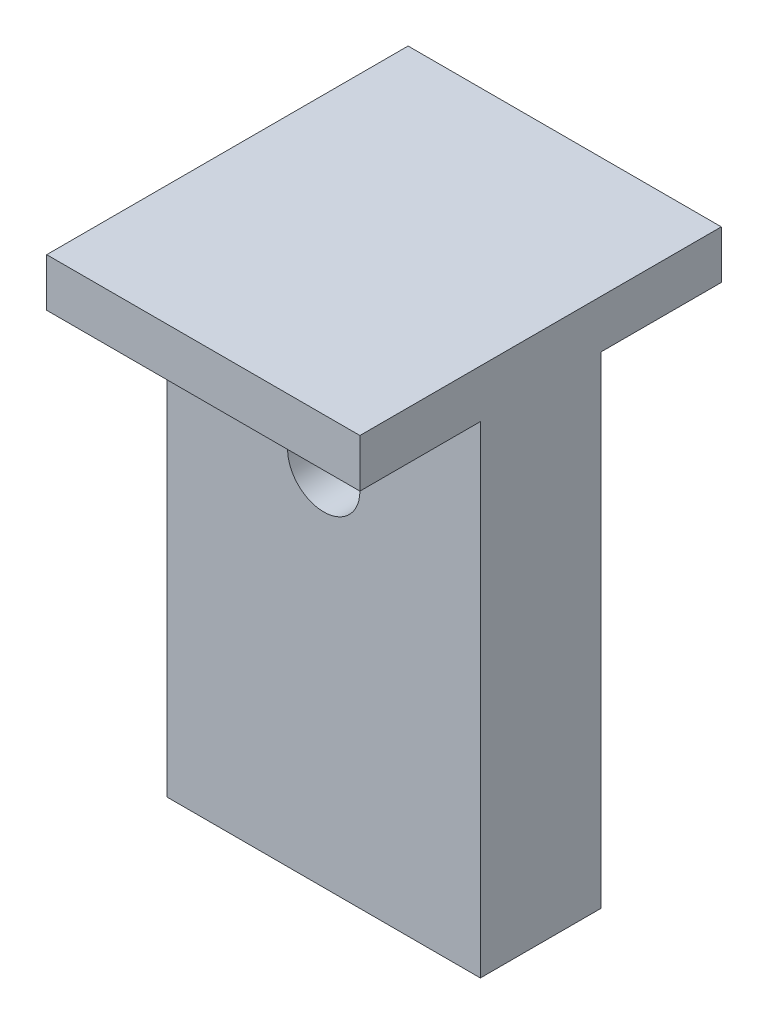
ISO-10303-21;
HEADER;
FILE_DESCRIPTION(('STEP AP214'),'2;1');
FILE_NAME('part.step','',(''),(''),'','','');
FILE_SCHEMA(('AUTOMOTIVE_DESIGN { 1 0 10303 214 1 1 1 1 }'));
ENDSEC;
DATA;
#1=APPLICATION_CONTEXT('core data for automotive mechanical design processes');
#2=APPLICATION_PROTOCOL_DEFINITION('international standard','automotive_design',2000,#1);
#3=PRODUCT_CONTEXT('',#1,'mechanical');
#4=PRODUCT('Part','Part','',(#3));
#5=PRODUCT_RELATED_PRODUCT_CATEGORY('part','',(#4));
#6=PRODUCT_DEFINITION_FORMATION('','',#4);
#7=PRODUCT_DEFINITION_CONTEXT('part definition',#1,'design');
#8=PRODUCT_DEFINITION('design','',#6,#7);
#9=PRODUCT_DEFINITION_SHAPE('','',#8);
#10=(LENGTH_UNIT() NAMED_UNIT(*) SI_UNIT(.MILLI.,.METRE.));
#11=(NAMED_UNIT(*) PLANE_ANGLE_UNIT() SI_UNIT($,.RADIAN.));
#12=(NAMED_UNIT(*) SI_UNIT($,.STERADIAN.) SOLID_ANGLE_UNIT());
#13=UNCERTAINTY_MEASURE_WITH_UNIT(LENGTH_MEASURE(1.E-05),#10,'distance_accuracy_value','');
#14=(GEOMETRIC_REPRESENTATION_CONTEXT(3) GLOBAL_UNCERTAINTY_ASSIGNED_CONTEXT((#13)) GLOBAL_UNIT_ASSIGNED_CONTEXT((#10,
#11,#12)) REPRESENTATION_CONTEXT('',''));
#15=CARTESIAN_POINT('',(0.,0.,0.));
#16=DIRECTION('',(0.,0.,1.));
#17=DIRECTION('',(1.,0.,0.));
#18=AXIS2_PLACEMENT_3D('',#15,#16,#17);
#19=CARTESIAN_POINT('',(6.5,20.,-2.5));
#20=DIRECTION('',(-1.,0.,0.));
#21=DIRECTION('',(0.,0.,1.));
#22=AXIS2_PLACEMENT_3D('',#19,#20,#21);
#23=PLANE('',#22);
#24=DIRECTION('',(0.,0.,-1.));
#25=VECTOR('',#24,1.);
#26=CARTESIAN_POINT('',(6.5,0.,-2.5));
#27=LINE('',#26,#25);
#28=CARTESIAN_POINT('',(6.5,0.,2.5));
#29=VERTEX_POINT('',#28);
#30=CARTESIAN_POINT('',(6.5,0.,-2.5));
#31=VERTEX_POINT('',#30);
#32=EDGE_CURVE('E186',#29,#31,#27,.T.);
#33=ORIENTED_EDGE('',*,*,#32,.T.);
#34=DIRECTION('',(0.,-1.,0.));
#35=VECTOR('',#34,1.);
#36=CARTESIAN_POINT('',(6.5,20.,-2.5));
#37=LINE('',#36,#35);
#38=CARTESIAN_POINT('',(6.5,20.,-2.5));
#39=VERTEX_POINT('',#38);
#40=EDGE_CURVE('E11',#39,#31,#37,.T.);
#41=ORIENTED_EDGE('',*,*,#40,.F.);
#42=DIRECTION('',(0.,0.,-1.));
#43=VECTOR('',#42,1.);
#44=CARTESIAN_POINT('',(6.5,20.,-7.5));
#45=LINE('',#44,#43);
#46=CARTESIAN_POINT('',(6.5,20.,-7.5));
#47=VERTEX_POINT('',#46);
#48=EDGE_CURVE('E231',#39,#47,#45,.T.);
#49=ORIENTED_EDGE('',*,*,#48,.T.);
#50=DIRECTION('',(0.,-1.,0.));
#51=VECTOR('',#50,1.);
#52=CARTESIAN_POINT('',(6.5,22.,-7.5));
#53=LINE('',#52,#51);
#54=CARTESIAN_POINT('',(6.5,22.,-7.5));
#55=VERTEX_POINT('',#54);
#56=EDGE_CURVE('E155',#55,#47,#53,.T.);
#57=ORIENTED_EDGE('',*,*,#56,.F.);
#58=DIRECTION('',(0.,0.,-1.));
#59=VECTOR('',#58,1.);
#60=CARTESIAN_POINT('',(6.5,22.,-7.5));
#61=LINE('',#60,#59);
#62=CARTESIAN_POINT('',(6.5,22.,7.5));
#63=VERTEX_POINT('',#62);
#64=EDGE_CURVE('E131',#63,#55,#61,.T.);
#65=ORIENTED_EDGE('',*,*,#64,.F.);
#66=DIRECTION('',(0.,-1.,0.));
#67=VECTOR('',#66,1.);
#68=CARTESIAN_POINT('',(6.5,22.,7.5));
#69=LINE('',#68,#67);
#70=CARTESIAN_POINT('',(6.5,20.,7.5));
#71=VERTEX_POINT('',#70);
#72=EDGE_CURVE('E127',#63,#71,#69,.T.);
#73=ORIENTED_EDGE('',*,*,#72,.T.);
#74=CARTESIAN_POINT('',(6.5,20.,2.5));
#75=VERTEX_POINT('',#74);
#76=EDGE_CURVE('E218',#71,#75,#45,.T.);
#77=ORIENTED_EDGE('',*,*,#76,.T.);
#78=DIRECTION('',(0.,-1.,0.));
#79=VECTOR('',#78,1.);
#80=CARTESIAN_POINT('',(6.5,20.,2.5));
#81=LINE('',#80,#79);
#82=EDGE_CURVE('E193',#75,#29,#81,.T.);
#83=ORIENTED_EDGE('',*,*,#82,.T.);
#84=EDGE_LOOP('',(#33,#41,#49,#57,#65,#73,#77,#83));
#85=FACE_BOUND('',#84,.T.);
#86=ADVANCED_FACE('F40',(#85),#23,.F.);
#87=CARTESIAN_POINT('',(-6.5,20.,-2.5));
#88=DIRECTION('',(0.,0.,1.));
#89=DIRECTION('',(1.,0.,0.));
#90=AXIS2_PLACEMENT_3D('',#87,#88,#89);
#91=PLANE('',#90);
#92=CARTESIAN_POINT('',(0.,15.,-2.5));
#93=DIRECTION('',(0.,0.,1.));
#94=DIRECTION('',(1.,0.,0.));
#95=AXIS2_PLACEMENT_3D('',#92,#93,#94);
#96=CIRCLE('',#95,1.5);
#97=CARTESIAN_POINT('',(1.5,15.,-2.5));
#98=VERTEX_POINT('',#97);
#99=EDGE_CURVE('E153',#98,#98,#96,.T.);
#100=ORIENTED_EDGE('',*,*,#99,.T.);
#101=EDGE_LOOP('',(#100));
#102=FACE_BOUND('',#101,.T.);
#103=DIRECTION('',(-1.,0.,0.));
#104=VECTOR('',#103,1.);
#105=CARTESIAN_POINT('',(-6.5,0.,-2.5));
#106=LINE('',#105,#104);
#107=CARTESIAN_POINT('',(-6.5,0.,-2.5));
#108=VERTEX_POINT('',#107);
#109=EDGE_CURVE('E197',#31,#108,#106,.T.);
#110=ORIENTED_EDGE('',*,*,#109,.T.);
#111=DIRECTION('',(0.,-1.,0.));
#112=VECTOR('',#111,1.);
#113=CARTESIAN_POINT('',(-6.5,20.,-2.5));
#114=LINE('',#113,#112);
#115=CARTESIAN_POINT('',(-6.5,20.,-2.5));
#116=VERTEX_POINT('',#115);
#117=EDGE_CURVE('E49',#116,#108,#114,.T.);
#118=ORIENTED_EDGE('',*,*,#117,.F.);
#119=DIRECTION('',(-1.,0.,0.));
#120=VECTOR('',#119,1.);
#121=CARTESIAN_POINT('',(-6.5,20.,-2.5));
#122=LINE('',#121,#120);
#123=EDGE_CURVE('E83',#39,#116,#122,.T.);
#124=ORIENTED_EDGE('',*,*,#123,.F.);
#125=ORIENTED_EDGE('',*,*,#40,.T.);
#126=EDGE_LOOP('',(#110,#118,#124,#125));
#127=FACE_BOUND('',#126,.T.);
#128=ADVANCED_FACE('F265',(#102,#127),#91,.F.);
#129=CARTESIAN_POINT('',(-6.5,20.,-2.5));
#130=DIRECTION('',(1.,0.,0.));
#131=DIRECTION('',(0.,0.,-1.));
#132=AXIS2_PLACEMENT_3D('',#129,#130,#131);
#133=PLANE('',#132);
#134=DIRECTION('',(0.,0.,1.));
#135=VECTOR('',#134,1.);
#136=CARTESIAN_POINT('',(-6.5,0.,-2.5));
#137=LINE('',#136,#135);
#138=CARTESIAN_POINT('',(-6.5,0.,2.5));
#139=VERTEX_POINT('',#138);
#140=EDGE_CURVE('E73',#108,#139,#137,.T.);
#141=ORIENTED_EDGE('',*,*,#140,.T.);
#142=DIRECTION('',(0.,-1.,0.));
#143=VECTOR('',#142,1.);
#144=CARTESIAN_POINT('',(-6.5,20.,2.5));
#145=LINE('',#144,#143);
#146=CARTESIAN_POINT('',(-6.5,20.,2.5));
#147=VERTEX_POINT('',#146);
#148=EDGE_CURVE('E57',#147,#139,#145,.T.);
#149=ORIENTED_EDGE('',*,*,#148,.F.);
#150=DIRECTION('',(0.,0.,1.));
#151=VECTOR('',#150,1.);
#152=CARTESIAN_POINT('',(-6.5,20.,-7.5));
#153=LINE('',#152,#151);
#154=CARTESIAN_POINT('',(-6.5,20.,7.5));
#155=VERTEX_POINT('',#154);
#156=EDGE_CURVE('E145',#147,#155,#153,.T.);
#157=ORIENTED_EDGE('',*,*,#156,.T.);
#158=DIRECTION('',(0.,-1.,0.));
#159=VECTOR('',#158,1.);
#160=CARTESIAN_POINT('',(-6.5,22.,7.5));
#161=LINE('',#160,#159);
#162=CARTESIAN_POINT('',(-6.5,22.,7.5));
#163=VERTEX_POINT('',#162);
#164=EDGE_CURVE('E125',#163,#155,#161,.T.);
#165=ORIENTED_EDGE('',*,*,#164,.F.);
#166=DIRECTION('',(0.,0.,1.));
#167=VECTOR('',#166,1.);
#168=CARTESIAN_POINT('',(-6.5,22.,-7.5));
#169=LINE('',#168,#167);
#170=CARTESIAN_POINT('',(-6.5,22.,-7.5));
#171=VERTEX_POINT('',#170);
#172=EDGE_CURVE('E132',#171,#163,#169,.T.);
#173=ORIENTED_EDGE('',*,*,#172,.F.);
#174=DIRECTION('',(0.,-1.,0.));
#175=VECTOR('',#174,1.);
#176=CARTESIAN_POINT('',(-6.5,22.,-7.5));
#177=LINE('',#176,#175);
#178=CARTESIAN_POINT('',(-6.5,20.,-7.5));
#179=VERTEX_POINT('',#178);
#180=EDGE_CURVE('E236',#171,#179,#177,.T.);
#181=ORIENTED_EDGE('',*,*,#180,.T.);
#182=EDGE_CURVE('E210',#179,#116,#153,.T.);
#183=ORIENTED_EDGE('',*,*,#182,.T.);
#184=ORIENTED_EDGE('',*,*,#117,.T.);
#185=EDGE_LOOP('',(#141,#149,#157,#165,#173,#181,#183,#184));
#186=FACE_BOUND('',#185,.T.);
#187=ADVANCED_FACE('F143',(#186),#133,.F.);
#188=CARTESIAN_POINT('',(-6.5,20.,2.5));
#189=DIRECTION('',(0.,0.,-1.));
#190=DIRECTION('',(-1.,0.,0.));
#191=AXIS2_PLACEMENT_3D('',#188,#189,#190);
#192=PLANE('',#191);
#193=CARTESIAN_POINT('',(0.,15.,2.5));
#194=DIRECTION('',(0.,0.,1.));
#195=DIRECTION('',(1.,0.,0.));
#196=AXIS2_PLACEMENT_3D('',#193,#194,#195);
#197=CIRCLE('',#196,1.49999999999999);
#198=CARTESIAN_POINT('',(1.49999999999999,15.,2.5));
#199=VERTEX_POINT('',#198);
#200=EDGE_CURVE('E148',#199,#199,#197,.T.);
#201=ORIENTED_EDGE('',*,*,#200,.F.);
#202=EDGE_LOOP('',(#201));
#203=FACE_BOUND('',#202,.T.);
#204=DIRECTION('',(1.,0.,0.));
#205=VECTOR('',#204,1.);
#206=CARTESIAN_POINT('',(-6.5,0.,2.5));
#207=LINE('',#206,#205);
#208=EDGE_CURVE('E78',#139,#29,#207,.T.);
#209=ORIENTED_EDGE('',*,*,#208,.T.);
#210=ORIENTED_EDGE('',*,*,#82,.F.);
#211=DIRECTION('',(1.,0.,0.));
#212=VECTOR('',#211,1.);
#213=CARTESIAN_POINT('',(-6.5,20.,2.5));
#214=LINE('',#213,#212);
#215=EDGE_CURVE('E189',#147,#75,#214,.T.);
#216=ORIENTED_EDGE('',*,*,#215,.F.);
#217=ORIENTED_EDGE('',*,*,#148,.T.);
#218=EDGE_LOOP('',(#209,#210,#216,#217));
#219=FACE_BOUND('',#218,.T.);
#220=ADVANCED_FACE('F219',(#203,#219),#192,.F.);
#221=CARTESIAN_POINT('',(0.,0.,0.));
#222=DIRECTION('',(0.,1.,0.));
#223=DIRECTION('',(0.,0.,1.));
#224=AXIS2_PLACEMENT_3D('',#221,#222,#223);
#225=PLANE('',#224);
#226=CARTESIAN_POINT('',(5.,0.,0.));
#227=DIRECTION('',(0.,-1.,0.));
#228=DIRECTION('',(0.,0.,-1.));
#229=AXIS2_PLACEMENT_3D('',#226,#227,#228);
#230=CIRCLE('',#229,0.5);
#231=CARTESIAN_POINT('',(5.,0.,-0.5));
#232=VERTEX_POINT('',#231);
#233=EDGE_CURVE('E162',#232,#232,#230,.T.);
#234=ORIENTED_EDGE('',*,*,#233,.F.);
#235=EDGE_LOOP('',(#234));
#236=FACE_BOUND('',#235,.T.);
#237=CARTESIAN_POINT('',(-5.,0.,0.));
#238=DIRECTION('',(0.,-1.,0.));
#239=DIRECTION('',(0.,0.,-1.));
#240=AXIS2_PLACEMENT_3D('',#237,#238,#239);
#241=CIRCLE('',#240,0.5);
#242=CARTESIAN_POINT('',(-5.,0.,-0.5));
#243=VERTEX_POINT('',#242);
#244=EDGE_CURVE('E170',#243,#243,#241,.T.);
#245=ORIENTED_EDGE('',*,*,#244,.F.);
#246=EDGE_LOOP('',(#245));
#247=FACE_BOUND('',#246,.T.);
#248=CARTESIAN_POINT('',(0.,0.,0.));
#249=DIRECTION('',(0.,-1.,0.));
#250=DIRECTION('',(0.,0.,-1.));
#251=AXIS2_PLACEMENT_3D('',#248,#249,#250);
#252=CIRCLE('',#251,0.79999999999999);
#253=CARTESIAN_POINT('',(0.,0.,-0.79999999999999));
#254=VERTEX_POINT('',#253);
#255=EDGE_CURVE('E178',#254,#254,#252,.T.);
#256=ORIENTED_EDGE('',*,*,#255,.F.);
#257=EDGE_LOOP('',(#256));
#258=FACE_BOUND('',#257,.T.);
#259=ORIENTED_EDGE('',*,*,#32,.F.);
#260=ORIENTED_EDGE('',*,*,#208,.F.);
#261=ORIENTED_EDGE('',*,*,#140,.F.);
#262=ORIENTED_EDGE('',*,*,#109,.F.);
#263=EDGE_LOOP('',(#259,#260,#261,#262));
#264=FACE_BOUND('',#263,.T.);
#265=ADVANCED_FACE('F213',(#236,#247,#258,#264),#225,.F.);
#266=CARTESIAN_POINT('',(0.,5.2,0.));
#267=DIRECTION('',(0.,-1.,0.));
#268=DIRECTION('',(0.,0.,-1.));
#269=AXIS2_PLACEMENT_3D('',#266,#267,#268);
#270=CONICAL_SURFACE('',#269,0.799999999999988,1.02974425867664);
#271=CARTESIAN_POINT('',(0.,5.68068849522205,0.));
#272=VERTEX_POINT('',#271);
#273=VERTEX_LOOP('',#272);
#274=FACE_BOUND('',#273,.T.);
#275=CARTESIAN_POINT('',(0.,5.2,0.));
#276=DIRECTION('',(0.,-1.,0.));
#277=DIRECTION('',(0.,0.,-1.));
#278=AXIS2_PLACEMENT_3D('',#275,#276,#277);
#279=CIRCLE('',#278,0.799999999999988);
#280=CARTESIAN_POINT('',(0.,5.2,-0.799999999999988));
#281=VERTEX_POINT('',#280);
#282=EDGE_CURVE('E182',#281,#281,#279,.T.);
#283=ORIENTED_EDGE('',*,*,#282,.T.);
#284=EDGE_LOOP('',(#283));
#285=FACE_BOUND('',#284,.T.);
#286=ADVANCED_FACE('F280',(#274,#285),#270,.F.);
#287=CARTESIAN_POINT('',(0.,0.,0.));
#288=DIRECTION('',(0.,-1.,0.));
#289=DIRECTION('',(0.,0.,-1.));
#290=AXIS2_PLACEMENT_3D('',#287,#288,#289);
#291=CYLINDRICAL_SURFACE('',#290,0.799999999999989);
#292=ORIENTED_EDGE('',*,*,#282,.F.);
#293=EDGE_LOOP('',(#292));
#294=FACE_BOUND('',#293,.T.);
#295=ORIENTED_EDGE('',*,*,#255,.T.);
#296=EDGE_LOOP('',(#295));
#297=FACE_BOUND('',#296,.T.);
#298=ADVANCED_FACE('F284',(#294,#297),#291,.F.);
#299=CARTESIAN_POINT('',(-5.,4.,0.));
#300=DIRECTION('',(0.,-1.,0.));
#301=DIRECTION('',(0.,0.,-1.));
#302=AXIS2_PLACEMENT_3D('',#299,#300,#301);
#303=CONICAL_SURFACE('',#302,0.499999999999999,1.02974425867665);
#304=CARTESIAN_POINT('',(-5.,4.30043030951378,0.));
#305=VERTEX_POINT('',#304);
#306=VERTEX_LOOP('',#305);
#307=FACE_BOUND('',#306,.T.);
#308=CARTESIAN_POINT('',(-5.,4.,0.));
#309=DIRECTION('',(0.,-1.,0.));
#310=DIRECTION('',(0.,0.,-1.));
#311=AXIS2_PLACEMENT_3D('',#308,#309,#310);
#312=CIRCLE('',#311,0.499999999999999);
#313=CARTESIAN_POINT('',(-5.,4.,-0.499999999999999));
#314=VERTEX_POINT('',#313);
#315=EDGE_CURVE('E174',#314,#314,#312,.T.);
#316=ORIENTED_EDGE('',*,*,#315,.T.);
#317=EDGE_LOOP('',(#316));
#318=FACE_BOUND('',#317,.T.);
#319=ADVANCED_FACE('F288',(#307,#318),#303,.F.);
#320=CARTESIAN_POINT('',(-5.,0.,0.));
#321=DIRECTION('',(0.,-1.,0.));
#322=DIRECTION('',(0.,0.,-1.));
#323=AXIS2_PLACEMENT_3D('',#320,#321,#322);
#324=CYLINDRICAL_SURFACE('',#323,0.499999999999999);
#325=ORIENTED_EDGE('',*,*,#315,.F.);
#326=EDGE_LOOP('',(#325));
#327=FACE_BOUND('',#326,.T.);
#328=ORIENTED_EDGE('',*,*,#244,.T.);
#329=EDGE_LOOP('',(#328));
#330=FACE_BOUND('',#329,.T.);
#331=ADVANCED_FACE('F292',(#327,#330),#324,.F.);
#332=CARTESIAN_POINT('',(5.,4.,0.));
#333=DIRECTION('',(0.,-1.,0.));
#334=DIRECTION('',(0.,0.,-1.));
#335=AXIS2_PLACEMENT_3D('',#332,#333,#334);
#336=CONICAL_SURFACE('',#335,0.499999999999999,1.02974425867665);
#337=CARTESIAN_POINT('',(5.,4.30043030951378,0.));
#338=VERTEX_POINT('',#337);
#339=VERTEX_LOOP('',#338);
#340=FACE_BOUND('',#339,.T.);
#341=CARTESIAN_POINT('',(5.,4.,0.));
#342=DIRECTION('',(0.,-1.,0.));
#343=DIRECTION('',(0.,0.,-1.));
#344=AXIS2_PLACEMENT_3D('',#341,#342,#343);
#345=CIRCLE('',#344,0.499999999999999);
#346=CARTESIAN_POINT('',(5.,4.,-0.499999999999999));
#347=VERTEX_POINT('',#346);
#348=EDGE_CURVE('E166',#347,#347,#345,.T.);
#349=ORIENTED_EDGE('',*,*,#348,.T.);
#350=EDGE_LOOP('',(#349));
#351=FACE_BOUND('',#350,.T.);
#352=ADVANCED_FACE('F296',(#340,#351),#336,.F.);
#353=CARTESIAN_POINT('',(5.,0.,0.));
#354=DIRECTION('',(0.,-1.,0.));
#355=DIRECTION('',(0.,0.,-1.));
#356=AXIS2_PLACEMENT_3D('',#353,#354,#355);
#357=CYLINDRICAL_SURFACE('',#356,0.499999999999999);
#358=ORIENTED_EDGE('',*,*,#348,.F.);
#359=EDGE_LOOP('',(#358));
#360=FACE_BOUND('',#359,.T.);
#361=ORIENTED_EDGE('',*,*,#233,.T.);
#362=EDGE_LOOP('',(#361));
#363=FACE_BOUND('',#362,.T.);
#364=ADVANCED_FACE('F258',(#360,#363),#357,.F.);
#365=CARTESIAN_POINT('',(0.,15.,2.5));
#366=DIRECTION('',(0.,0.,1.));
#367=DIRECTION('',(1.,0.,0.));
#368=AXIS2_PLACEMENT_3D('',#365,#366,#367);
#369=CYLINDRICAL_SURFACE('',#368,1.49999999999999);
#370=ORIENTED_EDGE('',*,*,#99,.F.);
#371=EDGE_LOOP('',(#370));
#372=FACE_BOUND('',#371,.T.);
#373=ORIENTED_EDGE('',*,*,#200,.T.);
#374=EDGE_LOOP('',(#373));
#375=FACE_BOUND('',#374,.T.);
#376=ADVANCED_FACE('F250',(#372,#375),#369,.F.);
#377=CARTESIAN_POINT('',(0.,20.,0.));
#378=DIRECTION('',(0.,-1.,0.));
#379=DIRECTION('',(0.,0.,-1.));
#380=AXIS2_PLACEMENT_3D('',#377,#378,#379);
#381=PLANE('',#380);
#382=ORIENTED_EDGE('',*,*,#48,.F.);
#383=ORIENTED_EDGE('',*,*,#123,.T.);
#384=ORIENTED_EDGE('',*,*,#182,.F.);
#385=DIRECTION('',(-1.,0.,0.));
#386=VECTOR('',#385,1.);
#387=CARTESIAN_POINT('',(6.5,20.,-7.5));
#388=LINE('',#387,#386);
#389=EDGE_CURVE('E141',#47,#179,#388,.T.);
#390=ORIENTED_EDGE('',*,*,#389,.F.);
#391=EDGE_LOOP('',(#382,#383,#384,#390));
#392=FACE_BOUND('',#391,.T.);
#393=ADVANCED_FACE('F245',(#392),#381,.T.);
#394=CARTESIAN_POINT('',(6.5,22.,7.5));
#395=DIRECTION('',(0.,0.,-1.));
#396=DIRECTION('',(-1.,0.,0.));
#397=AXIS2_PLACEMENT_3D('',#394,#395,#396);
#398=PLANE('',#397);
#399=DIRECTION('',(1.,0.,0.));
#400=VECTOR('',#399,1.);
#401=CARTESIAN_POINT('',(6.5,20.,7.5));
#402=LINE('',#401,#400);
#403=EDGE_CURVE('E222',#155,#71,#402,.T.);
#404=ORIENTED_EDGE('',*,*,#403,.T.);
#405=ORIENTED_EDGE('',*,*,#72,.F.);
#406=DIRECTION('',(1.,0.,0.));
#407=VECTOR('',#406,1.);
#408=CARTESIAN_POINT('',(6.5,22.,7.5));
#409=LINE('',#408,#407);
#410=EDGE_CURVE('E121',#163,#63,#409,.T.);
#411=ORIENTED_EDGE('',*,*,#410,.F.);
#412=ORIENTED_EDGE('',*,*,#164,.T.);
#413=EDGE_LOOP('',(#404,#405,#411,#412));
#414=FACE_BOUND('',#413,.T.);
#415=ADVANCED_FACE('F123',(#414),#398,.F.);
#416=CARTESIAN_POINT('',(6.5,22.,-7.5));
#417=DIRECTION('',(0.,0.,1.));
#418=DIRECTION('',(1.,0.,0.));
#419=AXIS2_PLACEMENT_3D('',#416,#417,#418);
#420=PLANE('',#419);
#421=ORIENTED_EDGE('',*,*,#389,.T.);
#422=ORIENTED_EDGE('',*,*,#180,.F.);
#423=DIRECTION('',(-1.,0.,0.));
#424=VECTOR('',#423,1.);
#425=CARTESIAN_POINT('',(6.5,22.,-7.5));
#426=LINE('',#425,#424);
#427=EDGE_CURVE('E137',#55,#171,#426,.T.);
#428=ORIENTED_EDGE('',*,*,#427,.F.);
#429=ORIENTED_EDGE('',*,*,#56,.T.);
#430=EDGE_LOOP('',(#421,#422,#428,#429));
#431=FACE_BOUND('',#430,.T.);
#432=ADVANCED_FACE('F243',(#431),#420,.F.);
#433=CARTESIAN_POINT('',(0.,22.,0.));
#434=DIRECTION('',(0.,-1.,0.));
#435=DIRECTION('',(0.,0.,-1.));
#436=AXIS2_PLACEMENT_3D('',#433,#434,#435);
#437=PLANE('',#436);
#438=ORIENTED_EDGE('',*,*,#172,.T.);
#439=ORIENTED_EDGE('',*,*,#410,.T.);
#440=ORIENTED_EDGE('',*,*,#64,.T.);
#441=ORIENTED_EDGE('',*,*,#427,.T.);
#442=EDGE_LOOP('',(#438,#439,#440,#441));
#443=FACE_BOUND('',#442,.T.);
#444=ADVANCED_FACE('F135',(#443),#437,.F.);
#445=ORIENTED_EDGE('',*,*,#156,.F.);
#446=ORIENTED_EDGE('',*,*,#215,.T.);
#447=ORIENTED_EDGE('',*,*,#76,.F.);
#448=ORIENTED_EDGE('',*,*,#403,.F.);
#449=EDGE_LOOP('',(#445,#446,#447,#448));
#450=FACE_BOUND('',#449,.T.);
#451=ADVANCED_FACE('F221',(#450),#381,.T.);
#452=CLOSED_SHELL('',(#86,#128,#187,#220,#265,#286,#298,#319,#331,#352,#364,#376,#393,#415,#432,
#444,#451));
#453=MANIFOLD_SOLID_BREP('B2',#452);
#454=ADVANCED_BREP_SHAPE_REPRESENTATION('',(#18,#453),#14);
#455=SHAPE_DEFINITION_REPRESENTATION(#9,#454);
ENDSEC;
END-ISO-10303-21;
